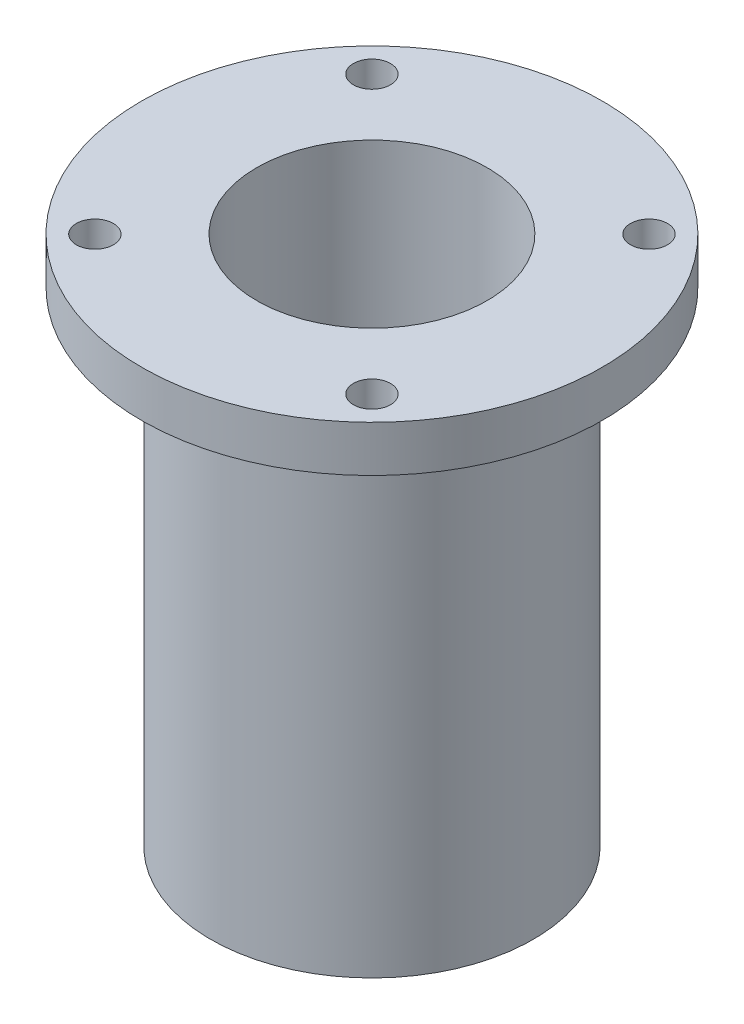
ISO-10303-21;
HEADER;
FILE_DESCRIPTION(('STEP AP214'),'2;1');
FILE_NAME('part.step','',(''),(''),'','','');
FILE_SCHEMA(('AUTOMOTIVE_DESIGN { 1 0 10303 214 1 1 1 1 }'));
ENDSEC;
DATA;
#1=APPLICATION_CONTEXT('core data for automotive mechanical design processes');
#2=APPLICATION_PROTOCOL_DEFINITION('international standard','automotive_design',2000,#1);
#3=PRODUCT_CONTEXT('',#1,'mechanical');
#4=PRODUCT('Part','Part','',(#3));
#5=PRODUCT_RELATED_PRODUCT_CATEGORY('part','',(#4));
#6=PRODUCT_DEFINITION_FORMATION('','',#4);
#7=PRODUCT_DEFINITION_CONTEXT('part definition',#1,'design');
#8=PRODUCT_DEFINITION('design','',#6,#7);
#9=PRODUCT_DEFINITION_SHAPE('','',#8);
#10=(LENGTH_UNIT() NAMED_UNIT(*) SI_UNIT(.MILLI.,.METRE.));
#11=(NAMED_UNIT(*) PLANE_ANGLE_UNIT() SI_UNIT($,.RADIAN.));
#12=(NAMED_UNIT(*) SI_UNIT($,.STERADIAN.) SOLID_ANGLE_UNIT());
#13=UNCERTAINTY_MEASURE_WITH_UNIT(LENGTH_MEASURE(1.E-05),#10,'distance_accuracy_value','');
#14=(GEOMETRIC_REPRESENTATION_CONTEXT(3) GLOBAL_UNCERTAINTY_ASSIGNED_CONTEXT((#13)) GLOBAL_UNIT_ASSIGNED_CONTEXT((#10,
#11,#12)) REPRESENTATION_CONTEXT('',''));
#15=CARTESIAN_POINT('',(0.,0.,0.));
#16=DIRECTION('',(0.,0.,1.));
#17=DIRECTION('',(1.,0.,0.));
#18=AXIS2_PLACEMENT_3D('',#15,#16,#17);
#19=CARTESIAN_POINT('',(0.,0.,0.));
#20=DIRECTION('',(0.,1.,0.));
#21=DIRECTION('',(-1.,0.,0.));
#22=AXIS2_PLACEMENT_3D('',#19,#20,#21);
#23=CYLINDRICAL_SURFACE('',#22,31.75);
#24=CARTESIAN_POINT('',(0.,-6.34999999999999,0.));
#25=DIRECTION('',(0.,1.,0.));
#26=DIRECTION('',(-1.,0.,0.));
#27=AXIS2_PLACEMENT_3D('',#24,#25,#26);
#28=CIRCLE('',#27,31.75);
#29=CARTESIAN_POINT('',(-31.75,-6.35,0.));
#30=VERTEX_POINT('',#29);
#31=EDGE_CURVE('E81',#30,#30,#28,.T.);
#32=ORIENTED_EDGE('',*,*,#31,.T.);
#33=EDGE_LOOP('',(#32));
#34=FACE_BOUND('',#33,.T.);
#35=CARTESIAN_POINT('',(0.,0.,0.));
#36=DIRECTION('',(0.,1.,0.));
#37=DIRECTION('',(-1.,0.,0.));
#38=AXIS2_PLACEMENT_3D('',#35,#36,#37);
#39=CIRCLE('',#38,31.75);
#40=CARTESIAN_POINT('',(-31.75,0.,0.));
#41=VERTEX_POINT('',#40);
#42=EDGE_CURVE('E10',#41,#41,#39,.T.);
#43=ORIENTED_EDGE('',*,*,#42,.F.);
#44=EDGE_LOOP('',(#43));
#45=FACE_BOUND('',#44,.T.);
#46=ADVANCED_FACE('F35',(#34,#45),#23,.T.);
#47=CARTESIAN_POINT('',(-31.75,0.,0.));
#48=DIRECTION('',(0.,1.,0.));
#49=DIRECTION('',(-1.,0.,0.));
#50=AXIS2_PLACEMENT_3D('',#47,#48,#49);
#51=PLANE('',#50);
#52=CARTESIAN_POINT('',(19.0830442572721,0.,19.0830442572718));
#53=DIRECTION('',(0.,1.,0.));
#54=DIRECTION('',(0.,0.,1.));
#55=AXIS2_PLACEMENT_3D('',#52,#53,#54);
#56=CIRCLE('',#55,2.5527);
#57=CARTESIAN_POINT('',(19.0830442572721,0.,21.6357442572718));
#58=VERTEX_POINT('',#57);
#59=EDGE_CURVE('E67',#58,#58,#56,.T.);
#60=ORIENTED_EDGE('',*,*,#59,.F.);
#61=EDGE_LOOP('',(#60));
#62=FACE_BOUND('',#61,.T.);
#63=CARTESIAN_POINT('',(-19.083044257272,0.,19.0830442572719));
#64=DIRECTION('',(0.,1.,0.));
#65=DIRECTION('',(0.,0.,1.));
#66=AXIS2_PLACEMENT_3D('',#63,#64,#65);
#67=CIRCLE('',#66,2.5527);
#68=CARTESIAN_POINT('',(-19.083044257272,0.,21.6357442572719));
#69=VERTEX_POINT('',#68);
#70=EDGE_CURVE('E57',#69,#69,#67,.T.);
#71=ORIENTED_EDGE('',*,*,#70,.F.);
#72=EDGE_LOOP('',(#71));
#73=FACE_BOUND('',#72,.T.);
#74=CARTESIAN_POINT('',(-19.0830442572719,0.,-19.083044257272));
#75=DIRECTION('',(0.,1.,0.));
#76=DIRECTION('',(0.,0.,1.));
#77=AXIS2_PLACEMENT_3D('',#74,#75,#76);
#78=CIRCLE('',#77,2.5527);
#79=CARTESIAN_POINT('',(-19.0830442572719,0.,-16.530344257272));
#80=VERTEX_POINT('',#79);
#81=EDGE_CURVE('E54',#80,#80,#78,.T.);
#82=ORIENTED_EDGE('',*,*,#81,.F.);
#83=EDGE_LOOP('',(#82));
#84=FACE_BOUND('',#83,.T.);
#85=CARTESIAN_POINT('',(19.083044257272,0.,-19.0830442572719));
#86=DIRECTION('',(0.,1.,0.));
#87=DIRECTION('',(0.,0.,1.));
#88=AXIS2_PLACEMENT_3D('',#85,#86,#87);
#89=CIRCLE('',#88,2.5527);
#90=CARTESIAN_POINT('',(19.083044257272,0.,-16.5303442572719));
#91=VERTEX_POINT('',#90);
#92=EDGE_CURVE('E53',#91,#91,#89,.T.);
#93=ORIENTED_EDGE('',*,*,#92,.F.);
#94=EDGE_LOOP('',(#93));
#95=FACE_BOUND('',#94,.T.);
#96=ORIENTED_EDGE('',*,*,#42,.T.);
#97=EDGE_LOOP('',(#96));
#98=FACE_BOUND('',#97,.T.);
#99=CARTESIAN_POINT('',(0.,0.,0.));
#100=DIRECTION('',(0.,1.,0.));
#101=DIRECTION('',(-1.,0.,0.));
#102=AXIS2_PLACEMENT_3D('',#99,#100,#101);
#103=CIRCLE('',#102,15.875);
#104=CARTESIAN_POINT('',(-15.875,0.,0.));
#105=VERTEX_POINT('',#104);
#106=EDGE_CURVE('E42',#105,#105,#103,.T.);
#107=ORIENTED_EDGE('',*,*,#106,.F.);
#108=EDGE_LOOP('',(#107));
#109=FACE_BOUND('',#108,.T.);
#110=ADVANCED_FACE('F96',(#62,#73,#84,#95,#98,#109),#51,.T.);
#111=CARTESIAN_POINT('',(0.,0.,0.));
#112=DIRECTION('',(0.,1.,0.));
#113=DIRECTION('',(-1.,0.,0.));
#114=AXIS2_PLACEMENT_3D('',#111,#112,#113);
#115=CYLINDRICAL_SURFACE('',#114,15.875);
#116=ORIENTED_EDGE('',*,*,#106,.T.);
#117=EDGE_LOOP('',(#116));
#118=FACE_BOUND('',#117,.T.);
#119=CARTESIAN_POINT('',(0.,-63.5,0.));
#120=DIRECTION('',(0.,1.,0.));
#121=DIRECTION('',(-1.,0.,0.));
#122=AXIS2_PLACEMENT_3D('',#119,#120,#121);
#123=CIRCLE('',#122,15.875);
#124=CARTESIAN_POINT('',(-15.875,-63.5,0.));
#125=VERTEX_POINT('',#124);
#126=EDGE_CURVE('E47',#125,#125,#123,.T.);
#127=ORIENTED_EDGE('',*,*,#126,.F.);
#128=EDGE_LOOP('',(#127));
#129=FACE_BOUND('',#128,.T.);
#130=ADVANCED_FACE('F94',(#118,#129),#115,.F.);
#131=CARTESIAN_POINT('',(-15.875,-63.5,0.));
#132=DIRECTION('',(0.,1.,0.));
#133=DIRECTION('',(-1.,0.,0.));
#134=AXIS2_PLACEMENT_3D('',#131,#132,#133);
#135=PLANE('',#134);
#136=CARTESIAN_POINT('',(0.,-63.5,0.));
#137=DIRECTION('',(0.,1.,0.));
#138=DIRECTION('',(-1.,0.,0.));
#139=AXIS2_PLACEMENT_3D('',#136,#137,#138);
#140=CIRCLE('',#139,7.13739999999999);
#141=CARTESIAN_POINT('',(-7.13739999999998,-63.5,0.));
#142=VERTEX_POINT('',#141);
#143=EDGE_CURVE('E78',#142,#142,#140,.T.);
#144=ORIENTED_EDGE('',*,*,#143,.F.);
#145=EDGE_LOOP('',(#144));
#146=FACE_BOUND('',#145,.T.);
#147=ORIENTED_EDGE('',*,*,#126,.T.);
#148=EDGE_LOOP('',(#147));
#149=FACE_BOUND('',#148,.T.);
#150=ADVANCED_FACE('F92',(#146,#149),#135,.T.);
#151=CARTESIAN_POINT('',(0.,-73.025,0.));
#152=DIRECTION('',(0.,-1.,0.));
#153=DIRECTION('',(1.,0.,0.));
#154=AXIS2_PLACEMENT_3D('',#151,#152,#153);
#155=PLANE('',#154);
#156=CARTESIAN_POINT('',(0.,-73.025,0.));
#157=DIRECTION('',(0.,-1.,0.));
#158=DIRECTION('',(0.,0.,-1.));
#159=AXIS2_PLACEMENT_3D('',#156,#157,#158);
#160=CIRCLE('',#159,7.13739999999999);
#161=CARTESIAN_POINT('',(0.,-73.025,-7.13739999999999));
#162=VERTEX_POINT('',#161);
#163=EDGE_CURVE('E75',#162,#162,#160,.T.);
#164=ORIENTED_EDGE('',*,*,#163,.F.);
#165=EDGE_LOOP('',(#164));
#166=FACE_BOUND('',#165,.T.);
#167=CARTESIAN_POINT('',(0.,-73.025,0.));
#168=DIRECTION('',(0.,1.,0.));
#169=DIRECTION('',(-1.,0.,0.));
#170=AXIS2_PLACEMENT_3D('',#167,#168,#169);
#171=CIRCLE('',#170,22.225);
#172=CARTESIAN_POINT('',(-22.225,-73.025,0.));
#173=VERTEX_POINT('',#172);
#174=EDGE_CURVE('E87',#173,#173,#171,.T.);
#175=ORIENTED_EDGE('',*,*,#174,.F.);
#176=EDGE_LOOP('',(#175));
#177=FACE_BOUND('',#176,.T.);
#178=ADVANCED_FACE('F103',(#166,#177),#155,.T.);
#179=CARTESIAN_POINT('',(0.,0.,0.));
#180=DIRECTION('',(0.,1.,0.));
#181=DIRECTION('',(-1.,0.,0.));
#182=AXIS2_PLACEMENT_3D('',#179,#180,#181);
#183=CYLINDRICAL_SURFACE('',#182,22.225);
#184=ORIENTED_EDGE('',*,*,#174,.T.);
#185=EDGE_LOOP('',(#184));
#186=FACE_BOUND('',#185,.T.);
#187=CARTESIAN_POINT('',(0.,-6.34999999999999,0.));
#188=DIRECTION('',(0.,1.,0.));
#189=DIRECTION('',(-1.,0.,0.));
#190=AXIS2_PLACEMENT_3D('',#187,#188,#189);
#191=CIRCLE('',#190,22.225);
#192=CARTESIAN_POINT('',(-22.225,-6.34999999999999,0.));
#193=VERTEX_POINT('',#192);
#194=EDGE_CURVE('E84',#193,#193,#191,.T.);
#195=ORIENTED_EDGE('',*,*,#194,.F.);
#196=EDGE_LOOP('',(#195));
#197=FACE_BOUND('',#196,.T.);
#198=ADVANCED_FACE('F117',(#186,#197),#183,.T.);
#199=CARTESIAN_POINT('',(-22.225,-6.34999999999999,0.));
#200=DIRECTION('',(0.,-1.,0.));
#201=DIRECTION('',(1.,0.,0.));
#202=AXIS2_PLACEMENT_3D('',#199,#200,#201);
#203=PLANE('',#202);
#204=CARTESIAN_POINT('',(19.0830442572721,-6.34999999999999,19.0830442572718));
#205=DIRECTION('',(0.,-1.,0.));
#206=DIRECTION('',(1.,0.,0.));
#207=AXIS2_PLACEMENT_3D('',#204,#205,#206);
#208=CIRCLE('',#207,2.5527);
#209=CARTESIAN_POINT('',(21.6357442572721,-6.34999999999999,19.0830442572718));
#210=VERTEX_POINT('',#209);
#211=EDGE_CURVE('E38',#210,#210,#208,.T.);
#212=ORIENTED_EDGE('',*,*,#211,.F.);
#213=EDGE_LOOP('',(#212));
#214=FACE_BOUND('',#213,.T.);
#215=CARTESIAN_POINT('',(-19.083044257272,-6.34999999999999,19.0830442572719));
#216=DIRECTION('',(0.,-1.,0.));
#217=DIRECTION('',(1.,0.,0.));
#218=AXIS2_PLACEMENT_3D('',#215,#216,#217);
#219=CIRCLE('',#218,2.5527);
#220=CARTESIAN_POINT('',(-16.5303442572721,-6.34999999999999,19.0830442572719));
#221=VERTEX_POINT('',#220);
#222=EDGE_CURVE('E55',#221,#221,#219,.T.);
#223=ORIENTED_EDGE('',*,*,#222,.F.);
#224=EDGE_LOOP('',(#223));
#225=FACE_BOUND('',#224,.T.);
#226=CARTESIAN_POINT('',(-19.0830442572719,-6.34999999999999,-19.083044257272));
#227=DIRECTION('',(0.,-1.,0.));
#228=DIRECTION('',(1.,0.,0.));
#229=AXIS2_PLACEMENT_3D('',#226,#227,#228);
#230=CIRCLE('',#229,2.5527);
#231=CARTESIAN_POINT('',(-16.5303442572719,-6.34999999999999,-19.083044257272));
#232=VERTEX_POINT('',#231);
#233=EDGE_CURVE('E51',#232,#232,#230,.T.);
#234=ORIENTED_EDGE('',*,*,#233,.F.);
#235=EDGE_LOOP('',(#234));
#236=FACE_BOUND('',#235,.T.);
#237=CARTESIAN_POINT('',(19.083044257272,-6.34999999999999,-19.0830442572719));
#238=DIRECTION('',(0.,-1.,0.));
#239=DIRECTION('',(1.,0.,0.));
#240=AXIS2_PLACEMENT_3D('',#237,#238,#239);
#241=CIRCLE('',#240,2.5527);
#242=CARTESIAN_POINT('',(21.635744257272,-6.34999999999999,-19.0830442572719));
#243=VERTEX_POINT('',#242);
#244=EDGE_CURVE('E72',#243,#243,#241,.T.);
#245=ORIENTED_EDGE('',*,*,#244,.F.);
#246=EDGE_LOOP('',(#245));
#247=FACE_BOUND('',#246,.T.);
#248=ORIENTED_EDGE('',*,*,#194,.T.);
#249=EDGE_LOOP('',(#248));
#250=FACE_BOUND('',#249,.T.);
#251=ORIENTED_EDGE('',*,*,#31,.F.);
#252=EDGE_LOOP('',(#251));
#253=FACE_BOUND('',#252,.T.);
#254=ADVANCED_FACE('F114',(#214,#225,#236,#247,#250,#253),#203,.T.);
#255=CARTESIAN_POINT('',(0.,-73.025,0.));
#256=DIRECTION('',(0.,-1.,0.));
#257=DIRECTION('',(0.,0.,-1.));
#258=AXIS2_PLACEMENT_3D('',#255,#256,#257);
#259=CYLINDRICAL_SURFACE('',#258,7.13739999999999);
#260=ORIENTED_EDGE('',*,*,#143,.T.);
#261=EDGE_LOOP('',(#260));
#262=FACE_BOUND('',#261,.T.);
#263=ORIENTED_EDGE('',*,*,#163,.T.);
#264=EDGE_LOOP('',(#263));
#265=FACE_BOUND('',#264,.T.);
#266=ADVANCED_FACE('F116',(#262,#265),#259,.F.);
#267=CARTESIAN_POINT('',(19.083044257272,0.,-19.0830442572719));
#268=DIRECTION('',(0.,1.,0.));
#269=DIRECTION('',(0.,0.,1.));
#270=AXIS2_PLACEMENT_3D('',#267,#268,#269);
#271=CYLINDRICAL_SURFACE('',#270,2.5527);
#272=ORIENTED_EDGE('',*,*,#244,.T.);
#273=EDGE_LOOP('',(#272));
#274=FACE_BOUND('',#273,.T.);
#275=ORIENTED_EDGE('',*,*,#92,.T.);
#276=EDGE_LOOP('',(#275));
#277=FACE_BOUND('',#276,.T.);
#278=ADVANCED_FACE('F124',(#274,#277),#271,.F.);
#279=CARTESIAN_POINT('',(-19.0830442572719,0.,-19.083044257272));
#280=DIRECTION('',(0.,1.,0.));
#281=DIRECTION('',(0.,0.,1.));
#282=AXIS2_PLACEMENT_3D('',#279,#280,#281);
#283=CYLINDRICAL_SURFACE('',#282,2.5527);
#284=ORIENTED_EDGE('',*,*,#233,.T.);
#285=EDGE_LOOP('',(#284));
#286=FACE_BOUND('',#285,.T.);
#287=ORIENTED_EDGE('',*,*,#81,.T.);
#288=EDGE_LOOP('',(#287));
#289=FACE_BOUND('',#288,.T.);
#290=ADVANCED_FACE('F188',(#286,#289),#283,.F.);
#291=CARTESIAN_POINT('',(-19.083044257272,0.,19.0830442572719));
#292=DIRECTION('',(0.,1.,0.));
#293=DIRECTION('',(0.,0.,1.));
#294=AXIS2_PLACEMENT_3D('',#291,#292,#293);
#295=CYLINDRICAL_SURFACE('',#294,2.5527);
#296=ORIENTED_EDGE('',*,*,#222,.T.);
#297=EDGE_LOOP('',(#296));
#298=FACE_BOUND('',#297,.T.);
#299=ORIENTED_EDGE('',*,*,#70,.T.);
#300=EDGE_LOOP('',(#299));
#301=FACE_BOUND('',#300,.T.);
#302=ADVANCED_FACE('F197',(#298,#301),#295,.F.);
#303=CARTESIAN_POINT('',(19.0830442572721,0.,19.0830442572718));
#304=DIRECTION('',(0.,1.,0.));
#305=DIRECTION('',(0.,0.,1.));
#306=AXIS2_PLACEMENT_3D('',#303,#304,#305);
#307=CYLINDRICAL_SURFACE('',#306,2.5527);
#308=ORIENTED_EDGE('',*,*,#211,.T.);
#309=EDGE_LOOP('',(#308));
#310=FACE_BOUND('',#309,.T.);
#311=ORIENTED_EDGE('',*,*,#59,.T.);
#312=EDGE_LOOP('',(#311));
#313=FACE_BOUND('',#312,.T.);
#314=ADVANCED_FACE('F207',(#310,#313),#307,.F.);
#315=CLOSED_SHELL('',(#46,#110,#130,#150,#178,#198,#254,#266,#278,#290,#302,#314));
#316=MANIFOLD_SOLID_BREP('B2',#315);
#317=ADVANCED_BREP_SHAPE_REPRESENTATION('',(#18,#316),#14);
#318=SHAPE_DEFINITION_REPRESENTATION(#9,#317);
ENDSEC;
END-ISO-10303-21;
